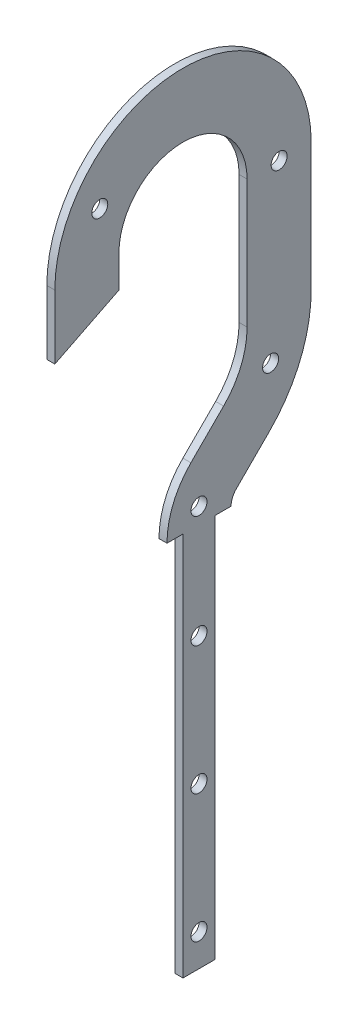
ISO-10303-21;
HEADER;
FILE_DESCRIPTION(('STEP AP214'),'2;1');
FILE_NAME('part.step','',(''),(''),'','','');
FILE_SCHEMA(('AUTOMOTIVE_DESIGN { 1 0 10303 214 1 1 1 1 }'));
ENDSEC;
DATA;
#1=APPLICATION_CONTEXT('core data for automotive mechanical design processes');
#2=APPLICATION_PROTOCOL_DEFINITION('international standard','automotive_design',2000,#1);
#3=PRODUCT_CONTEXT('',#1,'mechanical');
#4=PRODUCT('Part','Part','',(#3));
#5=PRODUCT_RELATED_PRODUCT_CATEGORY('part','',(#4));
#6=PRODUCT_DEFINITION_FORMATION('','',#4);
#7=PRODUCT_DEFINITION_CONTEXT('part definition',#1,'design');
#8=PRODUCT_DEFINITION('design','',#6,#7);
#9=PRODUCT_DEFINITION_SHAPE('','',#8);
#10=(LENGTH_UNIT() NAMED_UNIT(*) SI_UNIT(.MILLI.,.METRE.));
#11=(NAMED_UNIT(*) PLANE_ANGLE_UNIT() SI_UNIT($,.RADIAN.));
#12=(NAMED_UNIT(*) SI_UNIT($,.STERADIAN.) SOLID_ANGLE_UNIT());
#13=UNCERTAINTY_MEASURE_WITH_UNIT(LENGTH_MEASURE(1.E-05),#10,'distance_accuracy_value','');
#14=(GEOMETRIC_REPRESENTATION_CONTEXT(3) GLOBAL_UNCERTAINTY_ASSIGNED_CONTEXT((#13)) GLOBAL_UNIT_ASSIGNED_CONTEXT((#10,
#11,#12)) REPRESENTATION_CONTEXT('',''));
#15=CARTESIAN_POINT('',(0.,0.,0.));
#16=DIRECTION('',(0.,0.,1.));
#17=DIRECTION('',(1.,0.,0.));
#18=AXIS2_PLACEMENT_3D('',#15,#16,#17);
#19=CARTESIAN_POINT('',(3.175,0.,0.));
#20=DIRECTION('',(-1.,0.,0.));
#21=DIRECTION('',(0.,0.,1.));
#22=AXIS2_PLACEMENT_3D('',#19,#20,#21);
#23=CYLINDRICAL_SURFACE('',#22,50.8);
#24=CARTESIAN_POINT('',(0.,0.,0.));
#25=DIRECTION('',(1.,0.,0.));
#26=DIRECTION('',(0.,0.,-1.));
#27=AXIS2_PLACEMENT_3D('',#24,#25,#26);
#28=CIRCLE('',#27,50.8);
#29=CARTESIAN_POINT('',(0.,0.,-50.8));
#30=VERTEX_POINT('',#29);
#31=CARTESIAN_POINT('',(0.,0.,50.8));
#32=VERTEX_POINT('',#31);
#33=EDGE_CURVE('E336',#30,#32,#28,.T.);
#34=ORIENTED_EDGE('',*,*,#33,.T.);
#35=DIRECTION('',(-1.,0.,0.));
#36=VECTOR('',#35,1.);
#37=CARTESIAN_POINT('',(3.175,0.,50.8));
#38=LINE('',#37,#36);
#39=CARTESIAN_POINT('',(3.175,0.,50.8));
#40=VERTEX_POINT('',#39);
#41=EDGE_CURVE('E12',#40,#32,#38,.T.);
#42=ORIENTED_EDGE('',*,*,#41,.F.);
#43=CARTESIAN_POINT('',(3.175,0.,0.));
#44=DIRECTION('',(1.,0.,0.));
#45=DIRECTION('',(0.,0.,-1.));
#46=AXIS2_PLACEMENT_3D('',#43,#44,#45);
#47=CIRCLE('',#46,50.8);
#48=CARTESIAN_POINT('',(3.175,0.,-50.8));
#49=VERTEX_POINT('',#48);
#50=EDGE_CURVE('E276',#49,#40,#47,.T.);
#51=ORIENTED_EDGE('',*,*,#50,.F.);
#52=DIRECTION('',(-1.,0.,0.));
#53=VECTOR('',#52,1.);
#54=CARTESIAN_POINT('',(3.175,0.,-50.8));
#55=LINE('',#54,#53);
#56=EDGE_CURVE('E203',#49,#30,#55,.T.);
#57=ORIENTED_EDGE('',*,*,#56,.T.);
#58=EDGE_LOOP('',(#34,#42,#51,#57));
#59=FACE_BOUND('',#58,.T.);
#60=ADVANCED_FACE('F44',(#59),#23,.T.);
#61=CARTESIAN_POINT('',(3.175,0.,50.8));
#62=DIRECTION('',(0.,0.,-1.));
#63=DIRECTION('',(-1.,0.,0.));
#64=AXIS2_PLACEMENT_3D('',#61,#62,#63);
#65=PLANE('',#64);
#66=DIRECTION('',(0.,-1.,0.));
#67=VECTOR('',#66,1.);
#68=CARTESIAN_POINT('',(0.,0.,50.8));
#69=LINE('',#68,#67);
#70=CARTESIAN_POINT('',(0.,-25.4,50.8));
#71=VERTEX_POINT('',#70);
#72=EDGE_CURVE('E342',#32,#71,#69,.T.);
#73=ORIENTED_EDGE('',*,*,#72,.T.);
#74=DIRECTION('',(-1.,0.,0.));
#75=VECTOR('',#74,1.);
#76=CARTESIAN_POINT('',(3.175,-25.4,50.8));
#77=LINE('',#76,#75);
#78=CARTESIAN_POINT('',(3.175,-25.4,50.8));
#79=VERTEX_POINT('',#78);
#80=EDGE_CURVE('E53',#79,#71,#77,.T.);
#81=ORIENTED_EDGE('',*,*,#80,.F.);
#82=DIRECTION('',(0.,-1.,0.));
#83=VECTOR('',#82,1.);
#84=CARTESIAN_POINT('',(3.175,0.,50.8));
#85=LINE('',#84,#83);
#86=EDGE_CURVE('E135',#40,#79,#85,.T.);
#87=ORIENTED_EDGE('',*,*,#86,.F.);
#88=ORIENTED_EDGE('',*,*,#41,.T.);
#89=EDGE_LOOP('',(#73,#81,#87,#88));
#90=FACE_BOUND('',#89,.T.);
#91=ADVANCED_FACE('F364',(#90),#65,.F.);
#92=CARTESIAN_POINT('',(3.175,-25.4,50.8));
#93=DIRECTION('',(0.,0.894427190999916,0.447213595499958));
#94=DIRECTION('',(0.,-0.447213595499958,0.894427190999916));
#95=AXIS2_PLACEMENT_3D('',#92,#93,#94);
#96=PLANE('',#95);
#97=DIRECTION('',(0.,0.447213595499958,-0.894427190999916));
#98=VECTOR('',#97,1.);
#99=CARTESIAN_POINT('',(0.,-25.4,50.8));
#100=LINE('',#99,#98);
#101=CARTESIAN_POINT('',(0.,-12.7,25.4));
#102=VERTEX_POINT('',#101);
#103=EDGE_CURVE('E376',#71,#102,#100,.T.);
#104=ORIENTED_EDGE('',*,*,#103,.T.);
#105=DIRECTION('',(-1.,0.,0.));
#106=VECTOR('',#105,1.);
#107=CARTESIAN_POINT('',(3.175,-12.7,25.4));
#108=LINE('',#107,#106);
#109=CARTESIAN_POINT('',(3.175,-12.7,25.4));
#110=VERTEX_POINT('',#109);
#111=EDGE_CURVE('E475',#110,#102,#108,.T.);
#112=ORIENTED_EDGE('',*,*,#111,.F.);
#113=DIRECTION('',(0.,0.447213595499958,-0.894427190999916));
#114=VECTOR('',#113,1.);
#115=CARTESIAN_POINT('',(3.175,-25.4,50.8));
#116=LINE('',#115,#114);
#117=EDGE_CURVE('E270',#79,#110,#116,.T.);
#118=ORIENTED_EDGE('',*,*,#117,.F.);
#119=ORIENTED_EDGE('',*,*,#80,.T.);
#120=EDGE_LOOP('',(#104,#112,#118,#119));
#121=FACE_BOUND('',#120,.T.);
#122=ADVANCED_FACE('F369',(#121),#96,.F.);
#123=CARTESIAN_POINT('',(3.175,0.,25.4));
#124=DIRECTION('',(0.,0.,1.));
#125=DIRECTION('',(1.,0.,0.));
#126=AXIS2_PLACEMENT_3D('',#123,#124,#125);
#127=PLANE('',#126);
#128=DIRECTION('',(0.,1.,0.));
#129=VECTOR('',#128,1.);
#130=CARTESIAN_POINT('',(0.,0.,25.4));
#131=LINE('',#130,#129);
#132=CARTESIAN_POINT('',(0.,0.,25.4));
#133=VERTEX_POINT('',#132);
#134=EDGE_CURVE('E381',#102,#133,#131,.T.);
#135=ORIENTED_EDGE('',*,*,#134,.T.);
#136=DIRECTION('',(-1.,0.,0.));
#137=VECTOR('',#136,1.);
#138=CARTESIAN_POINT('',(3.175,0.,25.4));
#139=LINE('',#138,#137);
#140=CARTESIAN_POINT('',(3.175,0.,25.4));
#141=VERTEX_POINT('',#140);
#142=EDGE_CURVE('E471',#141,#133,#139,.T.);
#143=ORIENTED_EDGE('',*,*,#142,.F.);
#144=DIRECTION('',(0.,1.,0.));
#145=VECTOR('',#144,1.);
#146=CARTESIAN_POINT('',(3.175,0.,25.4));
#147=LINE('',#146,#145);
#148=EDGE_CURVE('E262',#110,#141,#147,.T.);
#149=ORIENTED_EDGE('',*,*,#148,.F.);
#150=ORIENTED_EDGE('',*,*,#111,.T.);
#151=EDGE_LOOP('',(#135,#143,#149,#150));
#152=FACE_BOUND('',#151,.T.);
#153=ADVANCED_FACE('F488',(#152),#127,.F.);
#154=CARTESIAN_POINT('',(3.175,0.,0.));
#155=DIRECTION('',(-1.,0.,0.));
#156=DIRECTION('',(0.,0.,1.));
#157=AXIS2_PLACEMENT_3D('',#154,#155,#156);
#158=CYLINDRICAL_SURFACE('',#157,25.4);
#159=CARTESIAN_POINT('',(0.,0.,0.));
#160=DIRECTION('',(-1.,0.,0.));
#161=DIRECTION('',(0.,0.,-1.));
#162=AXIS2_PLACEMENT_3D('',#159,#160,#161);
#163=CIRCLE('',#162,25.4);
#164=CARTESIAN_POINT('',(0.,0.,-25.4));
#165=VERTEX_POINT('',#164);
#166=EDGE_CURVE('E386',#133,#165,#163,.T.);
#167=ORIENTED_EDGE('',*,*,#166,.T.);
#168=DIRECTION('',(-1.,0.,0.));
#169=VECTOR('',#168,1.);
#170=CARTESIAN_POINT('',(3.175,0.,-25.4));
#171=LINE('',#170,#169);
#172=CARTESIAN_POINT('',(3.175,0.,-25.4));
#173=VERTEX_POINT('',#172);
#174=EDGE_CURVE('E467',#173,#165,#171,.T.);
#175=ORIENTED_EDGE('',*,*,#174,.F.);
#176=CARTESIAN_POINT('',(3.175,0.,0.));
#177=DIRECTION('',(-1.,0.,0.));
#178=DIRECTION('',(0.,0.,-1.));
#179=AXIS2_PLACEMENT_3D('',#176,#177,#178);
#180=CIRCLE('',#179,25.4);
#181=EDGE_CURVE('E258',#141,#173,#180,.T.);
#182=ORIENTED_EDGE('',*,*,#181,.F.);
#183=ORIENTED_EDGE('',*,*,#142,.T.);
#184=EDGE_LOOP('',(#167,#175,#182,#183));
#185=FACE_BOUND('',#184,.T.);
#186=ADVANCED_FACE('F491',(#185),#158,.F.);
#187=CARTESIAN_POINT('',(3.175,0.,-25.4));
#188=DIRECTION('',(0.,0.,-1.));
#189=DIRECTION('',(0.,1.,0.));
#190=AXIS2_PLACEMENT_3D('',#187,#188,#189);
#191=PLANE('',#190);
#192=DIRECTION('',(0.,-1.,0.));
#193=VECTOR('',#192,1.);
#194=CARTESIAN_POINT('',(0.,0.,-25.4));
#195=LINE('',#194,#193);
#196=CARTESIAN_POINT('',(0.,-50.8,-25.4));
#197=VERTEX_POINT('',#196);
#198=EDGE_CURVE('E389',#165,#197,#195,.T.);
#199=ORIENTED_EDGE('',*,*,#198,.T.);
#200=DIRECTION('',(-1.,0.,0.));
#201=VECTOR('',#200,1.);
#202=CARTESIAN_POINT('',(3.175,-50.8,-25.4));
#203=LINE('',#202,#201);
#204=CARTESIAN_POINT('',(3.175,-50.8,-25.4));
#205=VERTEX_POINT('',#204);
#206=EDGE_CURVE('E463',#205,#197,#203,.T.);
#207=ORIENTED_EDGE('',*,*,#206,.F.);
#208=DIRECTION('',(0.,-1.,0.));
#209=VECTOR('',#208,1.);
#210=CARTESIAN_POINT('',(3.175,0.,-25.4));
#211=LINE('',#210,#209);
#212=EDGE_CURVE('E254',#173,#205,#211,.T.);
#213=ORIENTED_EDGE('',*,*,#212,.F.);
#214=ORIENTED_EDGE('',*,*,#174,.T.);
#215=EDGE_LOOP('',(#199,#207,#213,#214));
#216=FACE_BOUND('',#215,.T.);
#217=ADVANCED_FACE('F496',(#216),#191,.F.);
#218=CARTESIAN_POINT('',(3.175,-50.8,6.34999999999999));
#219=DIRECTION('',(-1.,0.,0.));
#220=DIRECTION('',(0.,0.,1.));
#221=AXIS2_PLACEMENT_3D('',#218,#219,#220);
#222=CYLINDRICAL_SURFACE('',#221,31.75);
#223=CARTESIAN_POINT('',(0.,-50.8,6.34999999999999));
#224=DIRECTION('',(-1.,0.,0.));
#225=DIRECTION('',(0.,0.,1.));
#226=AXIS2_PLACEMENT_3D('',#223,#224,#225);
#227=CIRCLE('',#226,31.75);
#228=CARTESIAN_POINT('',(0.,-73.2506403026729,-16.1006403026729));
#229=VERTEX_POINT('',#228);
#230=EDGE_CURVE('E392',#197,#229,#227,.T.);
#231=ORIENTED_EDGE('',*,*,#230,.T.);
#232=DIRECTION('',(-1.,0.,0.));
#233=VECTOR('',#232,1.);
#234=CARTESIAN_POINT('',(3.175,-73.2506403026729,-16.1006403026729));
#235=LINE('',#234,#233);
#236=CARTESIAN_POINT('',(3.175,-73.2506403026729,-16.1006403026729));
#237=VERTEX_POINT('',#236);
#238=EDGE_CURVE('E459',#237,#229,#235,.T.);
#239=ORIENTED_EDGE('',*,*,#238,.F.);
#240=CARTESIAN_POINT('',(3.175,-50.8,6.34999999999999));
#241=DIRECTION('',(-1.,0.,0.));
#242=DIRECTION('',(0.,0.,1.));
#243=AXIS2_PLACEMENT_3D('',#240,#241,#242);
#244=CIRCLE('',#243,31.75);
#245=EDGE_CURVE('E251',#205,#237,#244,.T.);
#246=ORIENTED_EDGE('',*,*,#245,.F.);
#247=ORIENTED_EDGE('',*,*,#206,.T.);
#248=EDGE_LOOP('',(#231,#239,#246,#247));
#249=FACE_BOUND('',#248,.T.);
#250=ADVANCED_FACE('F502',(#249),#222,.F.);
#251=CARTESIAN_POINT('',(3.175,-73.2506403026729,-16.1006403026729));
#252=DIRECTION('',(0.,-0.707106781186549,-0.707106781186546));
#253=DIRECTION('',(0.,0.707106781186546,-0.707106781186549));
#254=AXIS2_PLACEMENT_3D('',#251,#252,#253);
#255=PLANE('',#254);
#256=DIRECTION('',(0.,-0.707106781186546,0.707106781186549));
#257=VECTOR('',#256,1.);
#258=CARTESIAN_POINT('',(0.,-73.2506403026729,-16.1006403026729));
#259=LINE('',#258,#257);
#260=CARTESIAN_POINT('',(0.,-86.2206456830181,-3.13063492232766));
#261=VERTEX_POINT('',#260);
#262=EDGE_CURVE('E395',#229,#261,#259,.T.);
#263=ORIENTED_EDGE('',*,*,#262,.T.);
#264=DIRECTION('',(-1.,0.,0.));
#265=VECTOR('',#264,1.);
#266=CARTESIAN_POINT('',(3.175,-86.2206456830181,-3.13063492232766));
#267=LINE('',#266,#265);
#268=CARTESIAN_POINT('',(3.175,-86.2206456830181,-3.13063492232766));
#269=VERTEX_POINT('',#268);
#270=EDGE_CURVE('E455',#269,#261,#267,.T.);
#271=ORIENTED_EDGE('',*,*,#270,.F.);
#272=DIRECTION('',(0.,-0.707106781186546,0.707106781186549));
#273=VECTOR('',#272,1.);
#274=CARTESIAN_POINT('',(3.175,-73.2506403026729,-16.1006403026729));
#275=LINE('',#274,#273);
#276=EDGE_CURVE('E243',#237,#269,#275,.T.);
#277=ORIENTED_EDGE('',*,*,#276,.F.);
#278=ORIENTED_EDGE('',*,*,#238,.T.);
#279=EDGE_LOOP('',(#263,#271,#277,#278));
#280=FACE_BOUND('',#279,.T.);
#281=ADVANCED_FACE('F506',(#280),#255,.F.);
#282=CARTESIAN_POINT('',(3.175,-109.108923092409,-26.0189123317189));
#283=DIRECTION('',(-1.,0.,0.));
#284=DIRECTION('',(0.,0.,1.));
#285=AXIS2_PLACEMENT_3D('',#282,#283,#284);
#286=CYLINDRICAL_SURFACE('',#285,32.3689123317189);
#287=CARTESIAN_POINT('',(0.,-109.108923092409,-26.0189123317189));
#288=DIRECTION('',(1.,0.,0.));
#289=DIRECTION('',(0.,0.,-1.));
#290=AXIS2_PLACEMENT_3D('',#287,#288,#289);
#291=CIRCLE('',#290,32.3689123317189);
#292=CARTESIAN_POINT('',(0.,-109.108923092409,6.34999999999998));
#293=VERTEX_POINT('',#292);
#294=EDGE_CURVE('E398',#261,#293,#291,.T.);
#295=ORIENTED_EDGE('',*,*,#294,.T.);
#296=DIRECTION('',(-1.,0.,0.));
#297=VECTOR('',#296,1.);
#298=CARTESIAN_POINT('',(3.175,-109.108923092409,6.34999999999998));
#299=LINE('',#298,#297);
#300=CARTESIAN_POINT('',(3.175,-109.108923092409,6.34999999999998));
#301=VERTEX_POINT('',#300);
#302=EDGE_CURVE('E451',#301,#293,#299,.T.);
#303=ORIENTED_EDGE('',*,*,#302,.F.);
#304=CARTESIAN_POINT('',(3.175,-109.108923092409,-26.0189123317189));
#305=DIRECTION('',(1.,0.,0.));
#306=DIRECTION('',(0.,0.,-1.));
#307=AXIS2_PLACEMENT_3D('',#304,#305,#306);
#308=CIRCLE('',#307,32.3689123317189);
#309=EDGE_CURVE('E239',#269,#301,#308,.T.);
#310=ORIENTED_EDGE('',*,*,#309,.F.);
#311=ORIENTED_EDGE('',*,*,#270,.T.);
#312=EDGE_LOOP('',(#295,#303,#310,#311));
#313=FACE_BOUND('',#312,.T.);
#314=ADVANCED_FACE('F541',(#313),#286,.T.);
#315=CARTESIAN_POINT('',(3.175,-109.108923092409,6.34999999999998));
#316=DIRECTION('',(0.,1.,0.));
#317=DIRECTION('',(0.,0.,1.));
#318=AXIS2_PLACEMENT_3D('',#315,#316,#317);
#319=PLANE('',#318);
#320=DIRECTION('',(0.,0.,-1.));
#321=VECTOR('',#320,1.);
#322=CARTESIAN_POINT('',(0.,-109.108923092409,6.34999999999998));
#323=LINE('',#322,#321);
#324=CARTESIAN_POINT('',(0.,-109.108923092409,0.));
#325=VERTEX_POINT('',#324);
#326=EDGE_CURVE('E401',#293,#325,#323,.T.);
#327=ORIENTED_EDGE('',*,*,#326,.T.);
#328=DIRECTION('',(-1.,0.,0.));
#329=VECTOR('',#328,1.);
#330=CARTESIAN_POINT('',(3.175,-109.108923092409,0.));
#331=LINE('',#330,#329);
#332=CARTESIAN_POINT('',(3.175,-109.108923092409,0.));
#333=VERTEX_POINT('',#332);
#334=EDGE_CURVE('E447',#333,#325,#331,.T.);
#335=ORIENTED_EDGE('',*,*,#334,.F.);
#336=DIRECTION('',(0.,0.,-1.));
#337=VECTOR('',#336,1.);
#338=CARTESIAN_POINT('',(3.175,-109.108923092409,6.34999999999998));
#339=LINE('',#338,#337);
#340=EDGE_CURVE('E235',#301,#333,#339,.T.);
#341=ORIENTED_EDGE('',*,*,#340,.F.);
#342=ORIENTED_EDGE('',*,*,#302,.T.);
#343=EDGE_LOOP('',(#327,#335,#341,#342));
#344=FACE_BOUND('',#343,.T.);
#345=ADVANCED_FACE('F538',(#344),#319,.F.);
#346=CARTESIAN_POINT('',(3.175,-109.108923092409,0.));
#347=DIRECTION('',(0.,0.,-1.));
#348=DIRECTION('',(0.,1.,0.));
#349=AXIS2_PLACEMENT_3D('',#346,#347,#348);
#350=PLANE('',#349);
#351=DIRECTION('',(0.,-1.,0.));
#352=VECTOR('',#351,1.);
#353=CARTESIAN_POINT('',(0.,-109.108923092409,0.));
#354=LINE('',#353,#352);
#355=CARTESIAN_POINT('',(0.,-261.50892309241,0.));
#356=VERTEX_POINT('',#355);
#357=EDGE_CURVE('E404',#325,#356,#354,.T.);
#358=ORIENTED_EDGE('',*,*,#357,.T.);
#359=DIRECTION('',(-1.,0.,0.));
#360=VECTOR('',#359,1.);
#361=CARTESIAN_POINT('',(3.175,-261.50892309241,0.));
#362=LINE('',#361,#360);
#363=CARTESIAN_POINT('',(3.175,-261.50892309241,0.));
#364=VERTEX_POINT('',#363);
#365=EDGE_CURVE('E443',#364,#356,#362,.T.);
#366=ORIENTED_EDGE('',*,*,#365,.F.);
#367=DIRECTION('',(0.,-1.,0.));
#368=VECTOR('',#367,1.);
#369=CARTESIAN_POINT('',(3.175,-109.108923092409,0.));
#370=LINE('',#369,#368);
#371=EDGE_CURVE('E232',#333,#364,#370,.T.);
#372=ORIENTED_EDGE('',*,*,#371,.F.);
#373=ORIENTED_EDGE('',*,*,#334,.T.);
#374=EDGE_LOOP('',(#358,#366,#372,#373));
#375=FACE_BOUND('',#374,.T.);
#376=ADVANCED_FACE('F534',(#375),#350,.F.);
#377=CARTESIAN_POINT('',(3.175,-261.50892309241,0.));
#378=DIRECTION('',(0.,1.,0.));
#379=DIRECTION('',(0.,0.,1.));
#380=AXIS2_PLACEMENT_3D('',#377,#378,#379);
#381=PLANE('',#380);
#382=DIRECTION('',(0.,0.,-1.));
#383=VECTOR('',#382,1.);
#384=CARTESIAN_POINT('',(0.,-261.50892309241,0.));
#385=LINE('',#384,#383);
#386=CARTESIAN_POINT('',(0.,-261.50892309241,-12.7));
#387=VERTEX_POINT('',#386);
#388=EDGE_CURVE('E407',#356,#387,#385,.T.);
#389=ORIENTED_EDGE('',*,*,#388,.T.);
#390=DIRECTION('',(-1.,0.,0.));
#391=VECTOR('',#390,1.);
#392=CARTESIAN_POINT('',(3.175,-261.50892309241,-12.7));
#393=LINE('',#392,#391);
#394=CARTESIAN_POINT('',(3.175,-261.50892309241,-12.7));
#395=VERTEX_POINT('',#394);
#396=EDGE_CURVE('E439',#395,#387,#393,.T.);
#397=ORIENTED_EDGE('',*,*,#396,.F.);
#398=DIRECTION('',(0.,0.,-1.));
#399=VECTOR('',#398,1.);
#400=CARTESIAN_POINT('',(3.175,-261.50892309241,0.));
#401=LINE('',#400,#399);
#402=EDGE_CURVE('E224',#364,#395,#401,.T.);
#403=ORIENTED_EDGE('',*,*,#402,.F.);
#404=ORIENTED_EDGE('',*,*,#365,.T.);
#405=EDGE_LOOP('',(#389,#397,#403,#404));
#406=FACE_BOUND('',#405,.T.);
#407=ADVANCED_FACE('F517',(#406),#381,.F.);
#408=CARTESIAN_POINT('',(3.175,-261.50892309241,-12.7));
#409=DIRECTION('',(0.,0.,1.));
#410=DIRECTION('',(1.,0.,0.));
#411=AXIS2_PLACEMENT_3D('',#408,#409,#410);
#412=PLANE('',#411);
#413=DIRECTION('',(0.,1.,0.));
#414=VECTOR('',#413,1.);
#415=CARTESIAN_POINT('',(0.,-261.50892309241,-12.7));
#416=LINE('',#415,#414);
#417=CARTESIAN_POINT('',(0.,-109.108923092409,-12.7));
#418=VERTEX_POINT('',#417);
#419=EDGE_CURVE('E410',#387,#418,#416,.T.);
#420=ORIENTED_EDGE('',*,*,#419,.T.);
#421=DIRECTION('',(-1.,0.,0.));
#422=VECTOR('',#421,1.);
#423=CARTESIAN_POINT('',(3.175,-109.108923092409,-12.7));
#424=LINE('',#423,#422);
#425=CARTESIAN_POINT('',(3.175,-109.108923092409,-12.7));
#426=VERTEX_POINT('',#425);
#427=EDGE_CURVE('E435',#426,#418,#424,.T.);
#428=ORIENTED_EDGE('',*,*,#427,.F.);
#429=DIRECTION('',(0.,1.,0.));
#430=VECTOR('',#429,1.);
#431=CARTESIAN_POINT('',(3.175,-261.50892309241,-12.7));
#432=LINE('',#431,#430);
#433=EDGE_CURVE('E220',#395,#426,#432,.T.);
#434=ORIENTED_EDGE('',*,*,#433,.F.);
#435=ORIENTED_EDGE('',*,*,#396,.T.);
#436=EDGE_LOOP('',(#420,#428,#434,#435));
#437=FACE_BOUND('',#436,.T.);
#438=ADVANCED_FACE('F521',(#437),#412,.F.);
#439=CARTESIAN_POINT('',(3.175,-109.108923092409,-12.7));
#440=DIRECTION('',(0.,1.,0.));
#441=DIRECTION('',(0.,0.,1.));
#442=AXIS2_PLACEMENT_3D('',#439,#440,#441);
#443=PLANE('',#442);
#444=DIRECTION('',(0.,0.,-1.));
#445=VECTOR('',#444,1.);
#446=CARTESIAN_POINT('',(0.,-109.108923092409,-12.7));
#447=LINE('',#446,#445);
#448=CARTESIAN_POINT('',(0.,-109.108923092409,-19.05));
#449=VERTEX_POINT('',#448);
#450=EDGE_CURVE('E413',#418,#449,#447,.T.);
#451=ORIENTED_EDGE('',*,*,#450,.T.);
#452=DIRECTION('',(-1.,0.,0.));
#453=VECTOR('',#452,1.);
#454=CARTESIAN_POINT('',(3.175,-109.108923092409,-19.05));
#455=LINE('',#454,#453);
#456=CARTESIAN_POINT('',(3.175,-109.108923092409,-19.05));
#457=VERTEX_POINT('',#456);
#458=EDGE_CURVE('E431',#457,#449,#455,.T.);
#459=ORIENTED_EDGE('',*,*,#458,.F.);
#460=DIRECTION('',(0.,0.,-1.));
#461=VECTOR('',#460,1.);
#462=CARTESIAN_POINT('',(3.175,-109.108923092409,-12.7));
#463=LINE('',#462,#461);
#464=EDGE_CURVE('E216',#426,#457,#463,.T.);
#465=ORIENTED_EDGE('',*,*,#464,.F.);
#466=ORIENTED_EDGE('',*,*,#427,.T.);
#467=EDGE_LOOP('',(#451,#459,#465,#466));
#468=FACE_BOUND('',#467,.T.);
#469=ADVANCED_FACE('F526',(#468),#443,.F.);
#470=CARTESIAN_POINT('',(3.175,-109.108923092409,-26.0189123317189));
#471=DIRECTION('',(-1.,0.,0.));
#472=DIRECTION('',(0.,0.,1.));
#473=AXIS2_PLACEMENT_3D('',#470,#471,#472);
#474=CYLINDRICAL_SURFACE('',#473,6.9689123317189);
#475=CARTESIAN_POINT('',(0.,-109.108923092409,-26.0189123317189));
#476=DIRECTION('',(-1.,0.,0.));
#477=DIRECTION('',(0.,0.,-1.));
#478=AXIS2_PLACEMENT_3D('',#475,#476,#477);
#479=CIRCLE('',#478,6.9689123317189);
#480=CARTESIAN_POINT('',(0.,-104.181157925156,-21.0911471644659));
#481=VERTEX_POINT('',#480);
#482=EDGE_CURVE('E416',#449,#481,#479,.T.);
#483=ORIENTED_EDGE('',*,*,#482,.T.);
#484=DIRECTION('',(-1.,0.,0.));
#485=VECTOR('',#484,1.);
#486=CARTESIAN_POINT('',(3.175,-104.181157925156,-21.0911471644659));
#487=LINE('',#486,#485);
#488=CARTESIAN_POINT('',(3.175,-104.181157925156,-21.0911471644659));
#489=VERTEX_POINT('',#488);
#490=EDGE_CURVE('E196',#489,#481,#487,.T.);
#491=ORIENTED_EDGE('',*,*,#490,.F.);
#492=CARTESIAN_POINT('',(3.175,-109.108923092409,-26.0189123317189));
#493=DIRECTION('',(-1.,0.,0.));
#494=DIRECTION('',(0.,0.,-1.));
#495=AXIS2_PLACEMENT_3D('',#492,#493,#494);
#496=CIRCLE('',#495,6.9689123317189);
#497=EDGE_CURVE('E185',#457,#489,#496,.T.);
#498=ORIENTED_EDGE('',*,*,#497,.F.);
#499=ORIENTED_EDGE('',*,*,#458,.T.);
#500=EDGE_LOOP('',(#483,#491,#498,#499));
#501=FACE_BOUND('',#500,.T.);
#502=ADVANCED_FACE('F529',(#501),#474,.F.);
#503=CARTESIAN_POINT('',(3.175,-91.2111525448112,-34.0611525448111));
#504=DIRECTION('',(0.,0.707106781186548,0.707106781186547));
#505=DIRECTION('',(0.,-0.707106781186547,0.707106781186548));
#506=AXIS2_PLACEMENT_3D('',#503,#504,#505);
#507=PLANE('',#506);
#508=DIRECTION('',(0.,0.707106781186547,-0.707106781186548));
#509=VECTOR('',#508,1.);
#510=CARTESIAN_POINT('',(0.,-91.2111525448112,-34.0611525448111));
#511=LINE('',#510,#509);
#512=CARTESIAN_POINT('',(0.,-91.2111525448112,-34.0611525448111));
#513=VERTEX_POINT('',#512);
#514=EDGE_CURVE('E194',#481,#513,#511,.T.);
#515=ORIENTED_EDGE('',*,*,#514,.T.);
#516=DIRECTION('',(-1.,0.,0.));
#517=VECTOR('',#516,1.);
#518=CARTESIAN_POINT('',(3.175,-91.2111525448112,-34.0611525448111));
#519=LINE('',#518,#517);
#520=CARTESIAN_POINT('',(3.175,-91.2111525448112,-34.0611525448111));
#521=VERTEX_POINT('',#520);
#522=EDGE_CURVE('E191',#521,#513,#519,.T.);
#523=ORIENTED_EDGE('',*,*,#522,.F.);
#524=DIRECTION('',(0.,0.707106781186547,-0.707106781186548));
#525=VECTOR('',#524,1.);
#526=CARTESIAN_POINT('',(3.175,-91.2111525448112,-34.0611525448111));
#527=LINE('',#526,#525);
#528=EDGE_CURVE('E179',#489,#521,#527,.T.);
#529=ORIENTED_EDGE('',*,*,#528,.F.);
#530=ORIENTED_EDGE('',*,*,#490,.T.);
#531=EDGE_LOOP('',(#515,#523,#529,#530));
#532=FACE_BOUND('',#531,.T.);
#533=ADVANCED_FACE('F192',(#532),#507,.F.);
#534=CARTESIAN_POINT('',(3.175,-50.8,6.34999999999999));
#535=DIRECTION('',(-1.,0.,0.));
#536=DIRECTION('',(0.,0.,1.));
#537=AXIS2_PLACEMENT_3D('',#534,#535,#536);
#538=CYLINDRICAL_SURFACE('',#537,57.15);
#539=CARTESIAN_POINT('',(0.,-50.8,6.34999999999999));
#540=DIRECTION('',(1.,0.,0.));
#541=DIRECTION('',(0.,0.,1.));
#542=AXIS2_PLACEMENT_3D('',#539,#540,#541);
#543=CIRCLE('',#542,57.15);
#544=CARTESIAN_POINT('',(0.,-50.8,-50.8));
#545=VERTEX_POINT('',#544);
#546=EDGE_CURVE('E121',#513,#545,#543,.T.);
#547=ORIENTED_EDGE('',*,*,#546,.T.);
#548=DIRECTION('',(-1.,0.,0.));
#549=VECTOR('',#548,1.);
#550=CARTESIAN_POINT('',(3.175,-50.8,-50.8));
#551=LINE('',#550,#549);
#552=CARTESIAN_POINT('',(3.175,-50.8,-50.8));
#553=VERTEX_POINT('',#552);
#554=EDGE_CURVE('E197',#553,#545,#551,.T.);
#555=ORIENTED_EDGE('',*,*,#554,.F.);
#556=CARTESIAN_POINT('',(3.175,-50.8,6.34999999999999));
#557=DIRECTION('',(1.,0.,0.));
#558=DIRECTION('',(0.,0.,1.));
#559=AXIS2_PLACEMENT_3D('',#556,#557,#558);
#560=CIRCLE('',#559,57.15);
#561=EDGE_CURVE('E183',#521,#553,#560,.T.);
#562=ORIENTED_EDGE('',*,*,#561,.F.);
#563=ORIENTED_EDGE('',*,*,#522,.T.);
#564=EDGE_LOOP('',(#547,#555,#562,#563));
#565=FACE_BOUND('',#564,.T.);
#566=ADVANCED_FACE('F199',(#565),#538,.T.);
#567=CARTESIAN_POINT('',(3.175,-50.8,-50.8));
#568=DIRECTION('',(0.,0.,1.));
#569=DIRECTION('',(1.,0.,0.));
#570=AXIS2_PLACEMENT_3D('',#567,#568,#569);
#571=PLANE('',#570);
#572=DIRECTION('',(0.,1.,0.));
#573=VECTOR('',#572,1.);
#574=CARTESIAN_POINT('',(0.,-50.8,-50.8));
#575=LINE('',#574,#573);
#576=EDGE_CURVE('E127',#545,#30,#575,.T.);
#577=ORIENTED_EDGE('',*,*,#576,.T.);
#578=ORIENTED_EDGE('',*,*,#56,.F.);
#579=DIRECTION('',(0.,1.,0.));
#580=VECTOR('',#579,1.);
#581=CARTESIAN_POINT('',(3.175,-50.8,-50.8));
#582=LINE('',#581,#580);
#583=EDGE_CURVE('E61',#553,#49,#582,.T.);
#584=ORIENTED_EDGE('',*,*,#583,.F.);
#585=ORIENTED_EDGE('',*,*,#554,.T.);
#586=EDGE_LOOP('',(#577,#578,#584,#585));
#587=FACE_BOUND('',#586,.T.);
#588=ADVANCED_FACE('F350',(#587),#571,.F.);
#589=CARTESIAN_POINT('',(3.175,0.,0.));
#590=DIRECTION('',(1.,0.,0.));
#591=DIRECTION('',(0.,0.,-1.));
#592=AXIS2_PLACEMENT_3D('',#589,#590,#591);
#593=PLANE('',#592);
#594=CARTESIAN_POINT('',(3.175,19.0499999999998,32.9955678841872));
#595=DIRECTION('',(1.,0.,0.));
#596=DIRECTION('',(0.,0.,-1.));
#597=AXIS2_PLACEMENT_3D('',#594,#595,#596);
#598=CIRCLE('',#597,3.175);
#599=CARTESIAN_POINT('',(3.175,19.0499999999998,29.8205678841872));
#600=VERTEX_POINT('',#599);
#601=EDGE_CURVE('E300',#600,#600,#598,.T.);
#602=ORIENTED_EDGE('',*,*,#601,.F.);
#603=EDGE_LOOP('',(#602));
#604=FACE_BOUND('',#603,.T.);
#605=CARTESIAN_POINT('',(3.175,-67.8102785686283,-34.7164452201267));
#606=DIRECTION('',(1.,0.,0.));
#607=DIRECTION('',(0.,0.,-1.));
#608=AXIS2_PLACEMENT_3D('',#605,#606,#607);
#609=CIRCLE('',#608,3.175);
#610=CARTESIAN_POINT('',(3.175,-67.8102785686283,-37.8914452201267));
#611=VERTEX_POINT('',#610);
#612=EDGE_CURVE('E311',#611,#611,#609,.T.);
#613=ORIENTED_EDGE('',*,*,#612,.F.);
#614=EDGE_LOOP('',(#613));
#615=FACE_BOUND('',#614,.T.);
#616=CARTESIAN_POINT('',(3.175,-102.75892309241,-6.35));
#617=DIRECTION('',(1.,0.,0.));
#618=DIRECTION('',(0.,0.,-1.));
#619=AXIS2_PLACEMENT_3D('',#616,#617,#618);
#620=CIRCLE('',#619,3.175);
#621=CARTESIAN_POINT('',(3.175,-102.75892309241,-9.525));
#622=VERTEX_POINT('',#621);
#623=EDGE_CURVE('E319',#622,#622,#620,.T.);
#624=ORIENTED_EDGE('',*,*,#623,.F.);
#625=EDGE_LOOP('',(#624));
#626=FACE_BOUND('',#625,.T.);
#627=CARTESIAN_POINT('',(3.175,-248.80892309241,-6.34999999999999));
#628=DIRECTION('',(1.,0.,0.));
#629=DIRECTION('',(0.,0.,-1.));
#630=AXIS2_PLACEMENT_3D('',#627,#628,#629);
#631=CIRCLE('',#630,3.175);
#632=CARTESIAN_POINT('',(3.175,-248.80892309241,-9.52499999999999));
#633=VERTEX_POINT('',#632);
#634=EDGE_CURVE('E328',#633,#633,#631,.T.);
#635=ORIENTED_EDGE('',*,*,#634,.F.);
#636=EDGE_LOOP('',(#635));
#637=FACE_BOUND('',#636,.T.);
#638=CARTESIAN_POINT('',(3.175,-198.00892309241,-6.34999999999981));
#639=DIRECTION('',(1.,0.,0.));
#640=DIRECTION('',(0.,0.,-1.));
#641=AXIS2_PLACEMENT_3D('',#638,#639,#640);
#642=CIRCLE('',#641,3.175);
#643=CARTESIAN_POINT('',(3.175,-198.00892309241,-9.52499999999981));
#644=VERTEX_POINT('',#643);
#645=EDGE_CURVE('E754',#644,#644,#642,.T.);
#646=ORIENTED_EDGE('',*,*,#645,.F.);
#647=EDGE_LOOP('',(#646));
#648=FACE_BOUND('',#647,.T.);
#649=CARTESIAN_POINT('',(3.175,-147.20892309241,-6.34999999999964));
#650=DIRECTION('',(1.,0.,0.));
#651=DIRECTION('',(0.,0.,-1.));
#652=AXIS2_PLACEMENT_3D('',#649,#650,#651);
#653=CIRCLE('',#652,3.175);
#654=CARTESIAN_POINT('',(3.175,-147.20892309241,-9.52499999999964));
#655=VERTEX_POINT('',#654);
#656=EDGE_CURVE('E289',#655,#655,#653,.T.);
#657=ORIENTED_EDGE('',*,*,#656,.F.);
#658=EDGE_LOOP('',(#657));
#659=FACE_BOUND('',#658,.T.);
#660=CARTESIAN_POINT('',(3.175,0.,-38.1));
#661=DIRECTION('',(1.,0.,0.));
#662=DIRECTION('',(0.,0.,-1.));
#663=AXIS2_PLACEMENT_3D('',#660,#661,#662);
#664=CIRCLE('',#663,3.175);
#665=CARTESIAN_POINT('',(3.175,0.,-41.275));
#666=VERTEX_POINT('',#665);
#667=EDGE_CURVE('E280',#666,#666,#664,.T.);
#668=ORIENTED_EDGE('',*,*,#667,.F.);
#669=EDGE_LOOP('',(#668));
#670=FACE_BOUND('',#669,.T.);
#671=ORIENTED_EDGE('',*,*,#50,.T.);
#672=ORIENTED_EDGE('',*,*,#86,.T.);
#673=ORIENTED_EDGE('',*,*,#117,.T.);
#674=ORIENTED_EDGE('',*,*,#148,.T.);
#675=ORIENTED_EDGE('',*,*,#181,.T.);
#676=ORIENTED_EDGE('',*,*,#212,.T.);
#677=ORIENTED_EDGE('',*,*,#245,.T.);
#678=ORIENTED_EDGE('',*,*,#276,.T.);
#679=ORIENTED_EDGE('',*,*,#309,.T.);
#680=ORIENTED_EDGE('',*,*,#340,.T.);
#681=ORIENTED_EDGE('',*,*,#371,.T.);
#682=ORIENTED_EDGE('',*,*,#402,.T.);
#683=ORIENTED_EDGE('',*,*,#433,.T.);
#684=ORIENTED_EDGE('',*,*,#464,.T.);
#685=ORIENTED_EDGE('',*,*,#497,.T.);
#686=ORIENTED_EDGE('',*,*,#528,.T.);
#687=ORIENTED_EDGE('',*,*,#561,.T.);
#688=ORIENTED_EDGE('',*,*,#583,.T.);
#689=EDGE_LOOP('',(#671,#672,#673,#674,#675,#676,#677,#678,#679,#680,#681,#682,#683,#684,#685,
#686,#687,#688));
#690=FACE_BOUND('',#689,.T.);
#691=ADVANCED_FACE('F181',(#604,#615,#626,#637,#648,#659,#670,#690),#593,.T.);
#692=CARTESIAN_POINT('',(0.,0.,0.));
#693=DIRECTION('',(1.,0.,0.));
#694=DIRECTION('',(0.,0.,-1.));
#695=AXIS2_PLACEMENT_3D('',#692,#693,#694);
#696=PLANE('',#695);
#697=CARTESIAN_POINT('',(0.,19.0499999999998,32.9955678841872));
#698=DIRECTION('',(1.,0.,0.));
#699=DIRECTION('',(0.,0.,-1.));
#700=AXIS2_PLACEMENT_3D('',#697,#698,#699);
#701=CIRCLE('',#700,3.175);
#702=CARTESIAN_POINT('',(0.,19.0499999999998,29.8205678841872));
#703=VERTEX_POINT('',#702);
#704=EDGE_CURVE('E296',#703,#703,#701,.T.);
#705=ORIENTED_EDGE('',*,*,#704,.T.);
#706=EDGE_LOOP('',(#705));
#707=FACE_BOUND('',#706,.T.);
#708=CARTESIAN_POINT('',(0.,-67.8102785686283,-34.7164452201267));
#709=DIRECTION('',(1.,0.,0.));
#710=DIRECTION('',(0.,0.,-1.));
#711=AXIS2_PLACEMENT_3D('',#708,#709,#710);
#712=CIRCLE('',#711,3.175);
#713=CARTESIAN_POINT('',(0.,-67.8102785686283,-37.8914452201267));
#714=VERTEX_POINT('',#713);
#715=EDGE_CURVE('E305',#714,#714,#712,.T.);
#716=ORIENTED_EDGE('',*,*,#715,.T.);
#717=EDGE_LOOP('',(#716));
#718=FACE_BOUND('',#717,.T.);
#719=CARTESIAN_POINT('',(0.,-102.75892309241,-6.35));
#720=DIRECTION('',(1.,0.,0.));
#721=DIRECTION('',(0.,0.,-1.));
#722=AXIS2_PLACEMENT_3D('',#719,#720,#721);
#723=CIRCLE('',#722,3.175);
#724=CARTESIAN_POINT('',(0.,-102.75892309241,-9.525));
#725=VERTEX_POINT('',#724);
#726=EDGE_CURVE('E316',#725,#725,#723,.T.);
#727=ORIENTED_EDGE('',*,*,#726,.T.);
#728=EDGE_LOOP('',(#727));
#729=FACE_BOUND('',#728,.T.);
#730=CARTESIAN_POINT('',(0.,-248.80892309241,-6.34999999999999));
#731=DIRECTION('',(1.,0.,0.));
#732=DIRECTION('',(0.,0.,-1.));
#733=AXIS2_PLACEMENT_3D('',#730,#731,#732);
#734=CIRCLE('',#733,3.175);
#735=CARTESIAN_POINT('',(0.,-248.80892309241,-9.52499999999999));
#736=VERTEX_POINT('',#735);
#737=EDGE_CURVE('E324',#736,#736,#734,.T.);
#738=ORIENTED_EDGE('',*,*,#737,.T.);
#739=EDGE_LOOP('',(#738));
#740=FACE_BOUND('',#739,.T.);
#741=CARTESIAN_POINT('',(0.,-198.00892309241,-6.34999999999981));
#742=DIRECTION('',(1.,0.,0.));
#743=DIRECTION('',(0.,0.,-1.));
#744=AXIS2_PLACEMENT_3D('',#741,#742,#743);
#745=CIRCLE('',#744,3.175);
#746=CARTESIAN_POINT('',(0.,-198.00892309241,-9.52499999999981));
#747=VERTEX_POINT('',#746);
#748=EDGE_CURVE('E332',#747,#747,#745,.T.);
#749=ORIENTED_EDGE('',*,*,#748,.T.);
#750=EDGE_LOOP('',(#749));
#751=FACE_BOUND('',#750,.T.);
#752=CARTESIAN_POINT('',(0.,-147.20892309241,-6.34999999999964));
#753=DIRECTION('',(1.,0.,0.));
#754=DIRECTION('',(0.,0.,-1.));
#755=AXIS2_PLACEMENT_3D('',#752,#753,#754);
#756=CIRCLE('',#755,3.175);
#757=CARTESIAN_POINT('',(0.,-147.20892309241,-9.52499999999964));
#758=VERTEX_POINT('',#757);
#759=EDGE_CURVE('E295',#758,#758,#756,.T.);
#760=ORIENTED_EDGE('',*,*,#759,.T.);
#761=EDGE_LOOP('',(#760));
#762=FACE_BOUND('',#761,.T.);
#763=CARTESIAN_POINT('',(0.,0.,-38.1));
#764=DIRECTION('',(1.,0.,0.));
#765=DIRECTION('',(0.,0.,-1.));
#766=AXIS2_PLACEMENT_3D('',#763,#764,#765);
#767=CIRCLE('',#766,3.175);
#768=CARTESIAN_POINT('',(0.,0.,-41.275));
#769=VERTEX_POINT('',#768);
#770=EDGE_CURVE('E333',#769,#769,#767,.T.);
#771=ORIENTED_EDGE('',*,*,#770,.T.);
#772=EDGE_LOOP('',(#771));
#773=FACE_BOUND('',#772,.T.);
#774=ORIENTED_EDGE('',*,*,#33,.F.);
#775=ORIENTED_EDGE('',*,*,#576,.F.);
#776=ORIENTED_EDGE('',*,*,#546,.F.);
#777=ORIENTED_EDGE('',*,*,#514,.F.);
#778=ORIENTED_EDGE('',*,*,#482,.F.);
#779=ORIENTED_EDGE('',*,*,#450,.F.);
#780=ORIENTED_EDGE('',*,*,#419,.F.);
#781=ORIENTED_EDGE('',*,*,#388,.F.);
#782=ORIENTED_EDGE('',*,*,#357,.F.);
#783=ORIENTED_EDGE('',*,*,#326,.F.);
#784=ORIENTED_EDGE('',*,*,#294,.F.);
#785=ORIENTED_EDGE('',*,*,#262,.F.);
#786=ORIENTED_EDGE('',*,*,#230,.F.);
#787=ORIENTED_EDGE('',*,*,#198,.F.);
#788=ORIENTED_EDGE('',*,*,#166,.F.);
#789=ORIENTED_EDGE('',*,*,#134,.F.);
#790=ORIENTED_EDGE('',*,*,#103,.F.);
#791=ORIENTED_EDGE('',*,*,#72,.F.);
#792=EDGE_LOOP('',(#774,#775,#776,#777,#778,#779,#780,#781,#782,#783,#784,#785,#786,#787,#788,
#789,#790,#791));
#793=FACE_BOUND('',#792,.T.);
#794=ADVANCED_FACE('F349',(#707,#718,#729,#740,#751,#762,#773,#793),#696,.F.);
#795=CARTESIAN_POINT('',(0.,0.,-38.1));
#796=DIRECTION('',(1.,0.,0.));
#797=DIRECTION('',(0.,0.,-1.));
#798=AXIS2_PLACEMENT_3D('',#795,#796,#797);
#799=CYLINDRICAL_SURFACE('',#798,3.175);
#800=ORIENTED_EDGE('',*,*,#770,.F.);
#801=EDGE_LOOP('',(#800));
#802=FACE_BOUND('',#801,.T.);
#803=ORIENTED_EDGE('',*,*,#667,.T.);
#804=EDGE_LOOP('',(#803));
#805=FACE_BOUND('',#804,.T.);
#806=ADVANCED_FACE('F346',(#802,#805),#799,.F.);
#807=CARTESIAN_POINT('',(0.,-147.20892309241,-6.34999999999964));
#808=DIRECTION('',(1.,0.,0.));
#809=DIRECTION('',(0.,0.,-1.));
#810=AXIS2_PLACEMENT_3D('',#807,#808,#809);
#811=CYLINDRICAL_SURFACE('',#810,3.175);
#812=ORIENTED_EDGE('',*,*,#759,.F.);
#813=EDGE_LOOP('',(#812));
#814=FACE_BOUND('',#813,.T.);
#815=ORIENTED_EDGE('',*,*,#656,.T.);
#816=EDGE_LOOP('',(#815));
#817=FACE_BOUND('',#816,.T.);
#818=ADVANCED_FACE('F675',(#814,#817),#811,.F.);
#819=CARTESIAN_POINT('',(0.,-198.00892309241,-6.34999999999981));
#820=DIRECTION('',(1.,0.,0.));
#821=DIRECTION('',(0.,0.,-1.));
#822=AXIS2_PLACEMENT_3D('',#819,#820,#821);
#823=CYLINDRICAL_SURFACE('',#822,3.175);
#824=ORIENTED_EDGE('',*,*,#748,.F.);
#825=EDGE_LOOP('',(#824));
#826=FACE_BOUND('',#825,.T.);
#827=ORIENTED_EDGE('',*,*,#645,.T.);
#828=EDGE_LOOP('',(#827));
#829=FACE_BOUND('',#828,.T.);
#830=ADVANCED_FACE('F684',(#826,#829),#823,.F.);
#831=CARTESIAN_POINT('',(0.,-248.80892309241,-6.34999999999999));
#832=DIRECTION('',(1.,0.,0.));
#833=DIRECTION('',(0.,0.,-1.));
#834=AXIS2_PLACEMENT_3D('',#831,#832,#833);
#835=CYLINDRICAL_SURFACE('',#834,3.175);
#836=ORIENTED_EDGE('',*,*,#737,.F.);
#837=EDGE_LOOP('',(#836));
#838=FACE_BOUND('',#837,.T.);
#839=ORIENTED_EDGE('',*,*,#634,.T.);
#840=EDGE_LOOP('',(#839));
#841=FACE_BOUND('',#840,.T.);
#842=ADVANCED_FACE('F694',(#838,#841),#835,.F.);
#843=CARTESIAN_POINT('',(0.,-102.75892309241,-6.35));
#844=DIRECTION('',(1.,0.,0.));
#845=DIRECTION('',(0.,0.,-1.));
#846=AXIS2_PLACEMENT_3D('',#843,#844,#845);
#847=CYLINDRICAL_SURFACE('',#846,3.175);
#848=ORIENTED_EDGE('',*,*,#726,.F.);
#849=EDGE_LOOP('',(#848));
#850=FACE_BOUND('',#849,.T.);
#851=ORIENTED_EDGE('',*,*,#623,.T.);
#852=EDGE_LOOP('',(#851));
#853=FACE_BOUND('',#852,.T.);
#854=ADVANCED_FACE('F704',(#850,#853),#847,.F.);
#855=CARTESIAN_POINT('',(0.,-67.8102785686283,-34.7164452201267));
#856=DIRECTION('',(1.,0.,0.));
#857=DIRECTION('',(0.,0.,-1.));
#858=AXIS2_PLACEMENT_3D('',#855,#856,#857);
#859=CYLINDRICAL_SURFACE('',#858,3.175);
#860=ORIENTED_EDGE('',*,*,#715,.F.);
#861=EDGE_LOOP('',(#860));
#862=FACE_BOUND('',#861,.T.);
#863=ORIENTED_EDGE('',*,*,#612,.T.);
#864=EDGE_LOOP('',(#863));
#865=FACE_BOUND('',#864,.T.);
#866=ADVANCED_FACE('F714',(#862,#865),#859,.F.);
#867=CARTESIAN_POINT('',(0.,19.0499999999998,32.9955678841872));
#868=DIRECTION('',(1.,0.,0.));
#869=DIRECTION('',(0.,0.,-1.));
#870=AXIS2_PLACEMENT_3D('',#867,#868,#869);
#871=CYLINDRICAL_SURFACE('',#870,3.175);
#872=ORIENTED_EDGE('',*,*,#704,.F.);
#873=EDGE_LOOP('',(#872));
#874=FACE_BOUND('',#873,.T.);
#875=ORIENTED_EDGE('',*,*,#601,.T.);
#876=EDGE_LOOP('',(#875));
#877=FACE_BOUND('',#876,.T.);
#878=ADVANCED_FACE('F724',(#874,#877),#871,.F.);
#879=CLOSED_SHELL('',(#60,#91,#122,#153,#186,#217,#250,#281,#314,#345,#376,#407,#438,#469,#502,
#533,#566,#588,#691,#794,#806,#818,#830,#842,#854,#866,#878));
#880=MANIFOLD_SOLID_BREP('B2',#879);
#881=ADVANCED_BREP_SHAPE_REPRESENTATION('',(#18,#880),#14);
#882=SHAPE_DEFINITION_REPRESENTATION(#9,#881);
ENDSEC;
END-ISO-10303-21;
